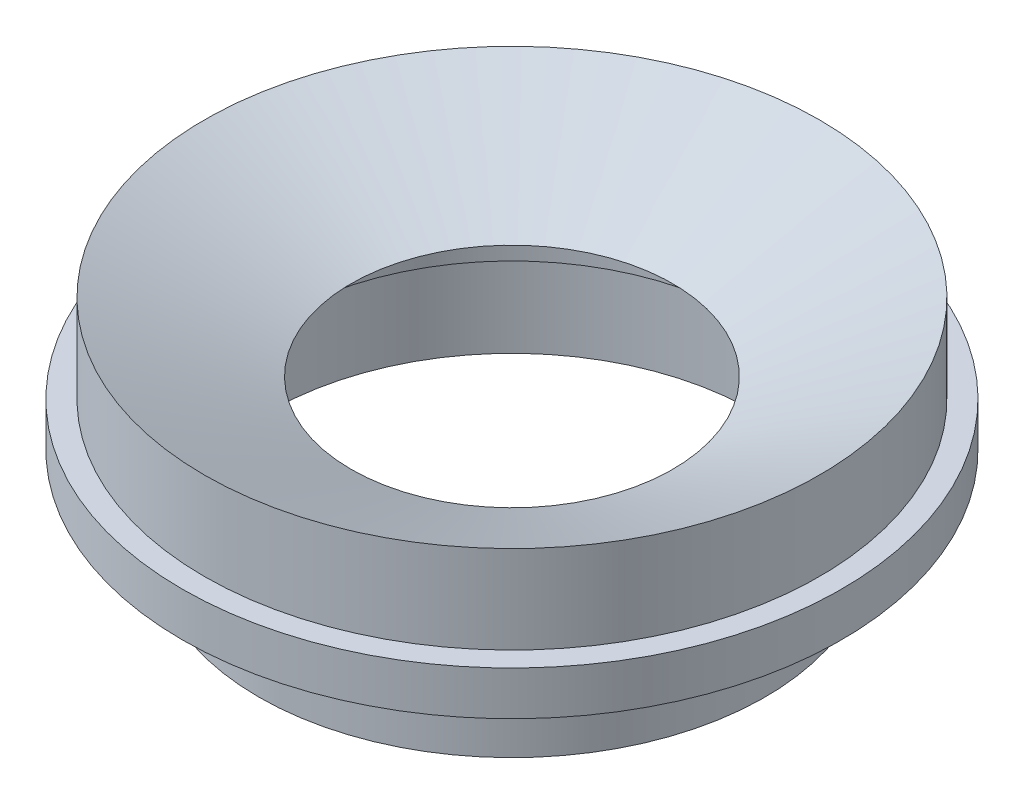
ISO-10303-21;
HEADER;
FILE_DESCRIPTION(('STEP AP214'),'2;1');
FILE_NAME('part.step','',(''),(''),'','','');
FILE_SCHEMA(('AUTOMOTIVE_DESIGN { 1 0 10303 214 1 1 1 1 }'));
ENDSEC;
DATA;
#1=APPLICATION_CONTEXT('core data for automotive mechanical design processes');
#2=APPLICATION_PROTOCOL_DEFINITION('international standard','automotive_design',2000,#1);
#3=PRODUCT_CONTEXT('',#1,'mechanical');
#4=PRODUCT('Part','Part','',(#3));
#5=PRODUCT_RELATED_PRODUCT_CATEGORY('part','',(#4));
#6=PRODUCT_DEFINITION_FORMATION('','',#4);
#7=PRODUCT_DEFINITION_CONTEXT('part definition',#1,'design');
#8=PRODUCT_DEFINITION('design','',#6,#7);
#9=PRODUCT_DEFINITION_SHAPE('','',#8);
#10=(LENGTH_UNIT() NAMED_UNIT(*) SI_UNIT(.MILLI.,.METRE.));
#11=(NAMED_UNIT(*) PLANE_ANGLE_UNIT() SI_UNIT($,.RADIAN.));
#12=(NAMED_UNIT(*) SI_UNIT($,.STERADIAN.) SOLID_ANGLE_UNIT());
#13=UNCERTAINTY_MEASURE_WITH_UNIT(LENGTH_MEASURE(1.E-05),#10,'distance_accuracy_value','');
#14=(GEOMETRIC_REPRESENTATION_CONTEXT(3) GLOBAL_UNCERTAINTY_ASSIGNED_CONTEXT((#13)) GLOBAL_UNIT_ASSIGNED_CONTEXT((#10,
#11,#12)) REPRESENTATION_CONTEXT('',''));
#15=CARTESIAN_POINT('',(0.,0.,0.));
#16=DIRECTION('',(0.,0.,1.));
#17=DIRECTION('',(1.,0.,0.));
#18=AXIS2_PLACEMENT_3D('',#15,#16,#17);
#19=CARTESIAN_POINT('',(0.,26.1546807597542,0.));
#20=DIRECTION('',(0.,1.,0.));
#21=DIRECTION('',(0.,0.,1.));
#22=AXIS2_PLACEMENT_3D('',#19,#20,#21);
#23=CYLINDRICAL_SURFACE('',#22,69.977);
#24=CARTESIAN_POINT('',(0.,-5.94980056260396,0.));
#25=DIRECTION('',(0.,1.,0.));
#26=DIRECTION('',(0.,0.,1.));
#27=AXIS2_PLACEMENT_3D('',#24,#25,#26);
#28=CIRCLE('',#27,69.977);
#29=CARTESIAN_POINT('',(0.,-5.94980056260396,69.977));
#30=VERTEX_POINT('',#29);
#31=EDGE_CURVE('E70',#30,#30,#28,.T.);
#32=ORIENTED_EDGE('',*,*,#31,.F.);
#33=EDGE_LOOP('',(#32));
#34=FACE_BOUND('',#33,.T.);
#35=CARTESIAN_POINT('',(0.,19.4161845617423,0.));
#36=DIRECTION('',(0.,1.,0.));
#37=DIRECTION('',(0.,0.,1.));
#38=AXIS2_PLACEMENT_3D('',#35,#36,#37);
#39=CIRCLE('',#38,69.977);
#40=CARTESIAN_POINT('',(0.,19.4161845617423,69.977));
#41=VERTEX_POINT('',#40);
#42=EDGE_CURVE('E10',#41,#41,#39,.T.);
#43=ORIENTED_EDGE('',*,*,#42,.T.);
#44=EDGE_LOOP('',(#43));
#45=FACE_BOUND('',#44,.T.);
#46=ADVANCED_FACE('F33',(#34,#45),#23,.F.);
#47=CARTESIAN_POINT('',(0.,19.4161845617423,0.));
#48=DIRECTION('',(0.,-1.,0.));
#49=DIRECTION('',(0.,0.,-1.));
#50=AXIS2_PLACEMENT_3D('',#47,#48,#49);
#51=PLANE('',#50);
#52=CARTESIAN_POINT('',(0.,19.4161845617423,0.));
#53=DIRECTION('',(0.,1.,0.));
#54=DIRECTION('',(0.,0.,1.));
#55=AXIS2_PLACEMENT_3D('',#52,#53,#54);
#56=CIRCLE('',#55,66.802);
#57=CARTESIAN_POINT('',(0.,19.4161845617423,66.802));
#58=VERTEX_POINT('',#57);
#59=EDGE_CURVE('E39',#58,#58,#56,.T.);
#60=ORIENTED_EDGE('',*,*,#59,.T.);
#61=EDGE_LOOP('',(#60));
#62=FACE_BOUND('',#61,.T.);
#63=ORIENTED_EDGE('',*,*,#42,.F.);
#64=EDGE_LOOP('',(#63));
#65=FACE_BOUND('',#64,.T.);
#66=ADVANCED_FACE('F77',(#62,#65),#51,.T.);
#67=CARTESIAN_POINT('',(0.,26.1546807597542,0.));
#68=DIRECTION('',(0.,1.,0.));
#69=DIRECTION('',(0.,0.,1.));
#70=AXIS2_PLACEMENT_3D('',#67,#68,#69);
#71=CYLINDRICAL_SURFACE('',#70,66.802);
#72=ORIENTED_EDGE('',*,*,#59,.F.);
#73=EDGE_LOOP('',(#72));
#74=FACE_BOUND('',#73,.T.);
#75=CARTESIAN_POINT('',(0.,37.7363463181235,0.));
#76=DIRECTION('',(0.,1.,0.));
#77=DIRECTION('',(0.,0.,1.));
#78=AXIS2_PLACEMENT_3D('',#75,#76,#77);
#79=CIRCLE('',#78,66.802);
#80=CARTESIAN_POINT('',(0.,37.7363463181235,66.802));
#81=VERTEX_POINT('',#80);
#82=EDGE_CURVE('E43',#81,#81,#79,.T.);
#83=ORIENTED_EDGE('',*,*,#82,.T.);
#84=EDGE_LOOP('',(#83));
#85=FACE_BOUND('',#84,.T.);
#86=ADVANCED_FACE('F81',(#74,#85),#71,.F.);
#87=CARTESIAN_POINT('',(0.,37.7363463181235,0.));
#88=DIRECTION('',(0.,1.,0.));
#89=DIRECTION('',(0.,0.,1.));
#90=AXIS2_PLACEMENT_3D('',#87,#88,#89);
#91=PLANE('',#90);
#92=ORIENTED_EDGE('',*,*,#82,.F.);
#93=EDGE_LOOP('',(#92));
#94=FACE_BOUND('',#93,.T.);
#95=CARTESIAN_POINT('',(0.,37.7363463181235,0.));
#96=DIRECTION('',(0.,1.,0.));
#97=DIRECTION('',(0.,0.,1.));
#98=AXIS2_PLACEMENT_3D('',#95,#96,#97);
#99=CIRCLE('',#98,46.482);
#100=CARTESIAN_POINT('',(0.,37.7363463181235,46.482));
#101=VERTEX_POINT('',#100);
#102=EDGE_CURVE('E47',#101,#101,#99,.T.);
#103=ORIENTED_EDGE('',*,*,#102,.T.);
#104=EDGE_LOOP('',(#103));
#105=FACE_BOUND('',#104,.T.);
#106=ADVANCED_FACE('F85',(#94,#105),#91,.F.);
#107=CARTESIAN_POINT('',(0.,37.7363463181235,0.));
#108=DIRECTION('',(0.,1.,0.));
#109=DIRECTION('',(0.,0.,1.));
#110=AXIS2_PLACEMENT_3D('',#107,#108,#109);
#111=CONICAL_SURFACE('',#110,46.482,1.13446401379631);
#112=CARTESIAN_POINT('',(0.,57.5161845617423,0.));
#113=DIRECTION('',(0.,1.,0.));
#114=DIRECTION('',(0.,0.,1.));
#115=AXIS2_PLACEMENT_3D('',#112,#113,#114);
#116=CIRCLE('',#115,88.9);
#117=CARTESIAN_POINT('',(0.,57.5161845617423,88.9));
#118=VERTEX_POINT('',#117);
#119=EDGE_CURVE('E52',#118,#118,#116,.T.);
#120=ORIENTED_EDGE('',*,*,#119,.T.);
#121=EDGE_LOOP('',(#120));
#122=FACE_BOUND('',#121,.T.);
#123=ORIENTED_EDGE('',*,*,#102,.F.);
#124=EDGE_LOOP('',(#123));
#125=FACE_BOUND('',#124,.T.);
#126=ADVANCED_FACE('F92',(#122,#125),#111,.F.);
#127=CARTESIAN_POINT('',(0.,26.1546807597542,0.));
#128=DIRECTION('',(0.,1.,0.));
#129=DIRECTION('',(0.,0.,1.));
#130=AXIS2_PLACEMENT_3D('',#127,#128,#129);
#131=CYLINDRICAL_SURFACE('',#130,88.9);
#132=CARTESIAN_POINT('',(0.,32.1161845617423,0.));
#133=DIRECTION('',(0.,1.,0.));
#134=DIRECTION('',(0.,0.,1.));
#135=AXIS2_PLACEMENT_3D('',#132,#133,#134);
#136=CIRCLE('',#135,88.9);
#137=CARTESIAN_POINT('',(0.,32.1161845617423,88.9));
#138=VERTEX_POINT('',#137);
#139=EDGE_CURVE('E55',#138,#138,#136,.T.);
#140=ORIENTED_EDGE('',*,*,#139,.T.);
#141=EDGE_LOOP('',(#140));
#142=FACE_BOUND('',#141,.T.);
#143=ORIENTED_EDGE('',*,*,#119,.F.);
#144=EDGE_LOOP('',(#143));
#145=FACE_BOUND('',#144,.T.);
#146=ADVANCED_FACE('F96',(#142,#145),#131,.T.);
#147=CARTESIAN_POINT('',(0.,32.1161845617423,0.));
#148=DIRECTION('',(0.,1.,0.));
#149=DIRECTION('',(0.,0.,1.));
#150=AXIS2_PLACEMENT_3D('',#147,#148,#149);
#151=PLANE('',#150);
#152=CARTESIAN_POINT('',(0.,32.1161845617423,0.));
#153=DIRECTION('',(0.,1.,0.));
#154=DIRECTION('',(0.,0.,1.));
#155=AXIS2_PLACEMENT_3D('',#152,#153,#154);
#156=CIRCLE('',#155,95.25);
#157=CARTESIAN_POINT('',(0.,32.1161845617423,95.25));
#158=VERTEX_POINT('',#157);
#159=EDGE_CURVE('E58',#158,#158,#156,.T.);
#160=ORIENTED_EDGE('',*,*,#159,.T.);
#161=EDGE_LOOP('',(#160));
#162=FACE_BOUND('',#161,.T.);
#163=ORIENTED_EDGE('',*,*,#139,.F.);
#164=EDGE_LOOP('',(#163));
#165=FACE_BOUND('',#164,.T.);
#166=ADVANCED_FACE('F100',(#162,#165),#151,.T.);
#167=CARTESIAN_POINT('',(0.,26.1546807597542,0.));
#168=DIRECTION('',(0.,1.,0.));
#169=DIRECTION('',(0.,0.,1.));
#170=AXIS2_PLACEMENT_3D('',#167,#168,#169);
#171=CYLINDRICAL_SURFACE('',#170,95.25);
#172=CARTESIAN_POINT('',(0.,19.4161845617423,0.));
#173=DIRECTION('',(0.,1.,0.));
#174=DIRECTION('',(0.,0.,1.));
#175=AXIS2_PLACEMENT_3D('',#172,#173,#174);
#176=CIRCLE('',#175,95.25);
#177=CARTESIAN_POINT('',(0.,19.4161845617423,95.25));
#178=VERTEX_POINT('',#177);
#179=EDGE_CURVE('E61',#178,#178,#176,.T.);
#180=ORIENTED_EDGE('',*,*,#179,.T.);
#181=EDGE_LOOP('',(#180));
#182=FACE_BOUND('',#181,.T.);
#183=ORIENTED_EDGE('',*,*,#159,.F.);
#184=EDGE_LOOP('',(#183));
#185=FACE_BOUND('',#184,.T.);
#186=ADVANCED_FACE('F104',(#182,#185),#171,.T.);
#187=CARTESIAN_POINT('',(0.,19.4161845617423,0.));
#188=DIRECTION('',(0.,-1.,0.));
#189=DIRECTION('',(0.,0.,-1.));
#190=AXIS2_PLACEMENT_3D('',#187,#188,#189);
#191=PLANE('',#190);
#192=CARTESIAN_POINT('',(0.,19.4161845617423,0.));
#193=DIRECTION('',(0.,1.,0.));
#194=DIRECTION('',(0.,0.,1.));
#195=AXIS2_PLACEMENT_3D('',#192,#193,#194);
#196=CIRCLE('',#195,73.152);
#197=CARTESIAN_POINT('',(0.,19.4161845617423,73.152));
#198=VERTEX_POINT('',#197);
#199=EDGE_CURVE('E64',#198,#198,#196,.T.);
#200=ORIENTED_EDGE('',*,*,#199,.T.);
#201=EDGE_LOOP('',(#200));
#202=FACE_BOUND('',#201,.T.);
#203=ORIENTED_EDGE('',*,*,#179,.F.);
#204=EDGE_LOOP('',(#203));
#205=FACE_BOUND('',#204,.T.);
#206=ADVANCED_FACE('F108',(#202,#205),#191,.T.);
#207=CARTESIAN_POINT('',(0.,26.1546807597542,0.));
#208=DIRECTION('',(0.,1.,0.));
#209=DIRECTION('',(0.,0.,1.));
#210=AXIS2_PLACEMENT_3D('',#207,#208,#209);
#211=CYLINDRICAL_SURFACE('',#210,73.152);
#212=CARTESIAN_POINT('',(0.,-5.94980056260396,0.));
#213=DIRECTION('',(0.,1.,0.));
#214=DIRECTION('',(0.,0.,1.));
#215=AXIS2_PLACEMENT_3D('',#212,#213,#214);
#216=CIRCLE('',#215,73.152);
#217=CARTESIAN_POINT('',(0.,-5.94980056260396,73.152));
#218=VERTEX_POINT('',#217);
#219=EDGE_CURVE('E67',#218,#218,#216,.T.);
#220=ORIENTED_EDGE('',*,*,#219,.T.);
#221=EDGE_LOOP('',(#220));
#222=FACE_BOUND('',#221,.T.);
#223=ORIENTED_EDGE('',*,*,#199,.F.);
#224=EDGE_LOOP('',(#223));
#225=FACE_BOUND('',#224,.T.);
#226=ADVANCED_FACE('F112',(#222,#225),#211,.T.);
#227=CARTESIAN_POINT('',(0.,-5.94980056260397,0.));
#228=DIRECTION('',(0.,1.,0.));
#229=DIRECTION('',(0.,0.,1.));
#230=AXIS2_PLACEMENT_3D('',#227,#228,#229);
#231=PLANE('',#230);
#232=ORIENTED_EDGE('',*,*,#219,.F.);
#233=EDGE_LOOP('',(#232));
#234=FACE_BOUND('',#233,.T.);
#235=ORIENTED_EDGE('',*,*,#31,.T.);
#236=EDGE_LOOP('',(#235));
#237=FACE_BOUND('',#236,.T.);
#238=ADVANCED_FACE('F74',(#234,#237),#231,.F.);
#239=CLOSED_SHELL('',(#46,#66,#86,#106,#126,#146,#166,#186,#206,#226,#238));
#240=MANIFOLD_SOLID_BREP('B2',#239);
#241=ADVANCED_BREP_SHAPE_REPRESENTATION('',(#18,#240),#14);
#242=SHAPE_DEFINITION_REPRESENTATION(#9,#241);
ENDSEC;
END-ISO-10303-21;
